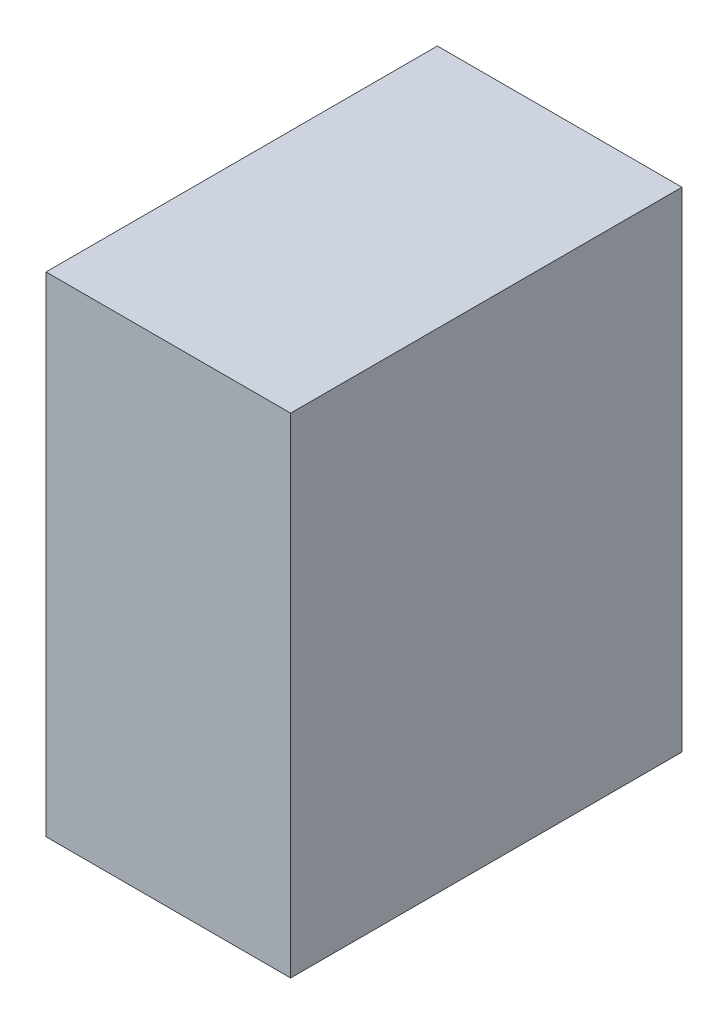
ISO-10303-21;
HEADER;
FILE_DESCRIPTION(('STEP AP214'),'2;1');
FILE_NAME('part.step','',(''),(''),'','','');
FILE_SCHEMA(('AUTOMOTIVE_DESIGN { 1 0 10303 214 1 1 1 1 }'));
ENDSEC;
DATA;
#1=APPLICATION_CONTEXT('core data for automotive mechanical design processes');
#2=APPLICATION_PROTOCOL_DEFINITION('international standard','automotive_design',2000,#1);
#3=PRODUCT_CONTEXT('',#1,'mechanical');
#4=PRODUCT('Part','Part','',(#3));
#5=PRODUCT_RELATED_PRODUCT_CATEGORY('part','',(#4));
#6=PRODUCT_DEFINITION_FORMATION('','',#4);
#7=PRODUCT_DEFINITION_CONTEXT('part definition',#1,'design');
#8=PRODUCT_DEFINITION('design','',#6,#7);
#9=PRODUCT_DEFINITION_SHAPE('','',#8);
#10=(LENGTH_UNIT() NAMED_UNIT(*) SI_UNIT(.MILLI.,.METRE.));
#11=(NAMED_UNIT(*) PLANE_ANGLE_UNIT() SI_UNIT($,.RADIAN.));
#12=(NAMED_UNIT(*) SI_UNIT($,.STERADIAN.) SOLID_ANGLE_UNIT());
#13=UNCERTAINTY_MEASURE_WITH_UNIT(LENGTH_MEASURE(1.E-05),#10,'distance_accuracy_value','');
#14=(GEOMETRIC_REPRESENTATION_CONTEXT(3) GLOBAL_UNCERTAINTY_ASSIGNED_CONTEXT((#13)) GLOBAL_UNIT_ASSIGNED_CONTEXT((#10,
#11,#12)) REPRESENTATION_CONTEXT('',''));
#15=CARTESIAN_POINT('',(0.,0.,0.));
#16=DIRECTION('',(0.,0.,1.));
#17=DIRECTION('',(1.,0.,0.));
#18=AXIS2_PLACEMENT_3D('',#15,#16,#17);
#19=CARTESIAN_POINT('',(-49.9999999999999,53.6184210526316,80.));
#20=DIRECTION('',(1.,0.,0.));
#21=DIRECTION('',(0.,0.,-1.));
#22=AXIS2_PLACEMENT_3D('',#19,#20,#21);
#23=PLANE('',#22);
#24=DIRECTION('',(0.,-1.,0.));
#25=VECTOR('',#24,1.);
#26=CARTESIAN_POINT('',(-49.9999999999999,53.6184210526316,0.));
#27=LINE('',#26,#25);
#28=CARTESIAN_POINT('',(-49.9999999999999,53.6184210526316,0.));
#29=VERTEX_POINT('',#28);
#30=CARTESIAN_POINT('',(-49.9999999999999,-46.3815789473684,0.));
#31=VERTEX_POINT('',#30);
#32=EDGE_CURVE('E107',#29,#31,#27,.T.);
#33=ORIENTED_EDGE('',*,*,#32,.T.);
#34=DIRECTION('',(0.,0.,-1.));
#35=VECTOR('',#34,1.);
#36=CARTESIAN_POINT('',(-49.9999999999999,-46.3815789473684,80.));
#37=LINE('',#36,#35);
#38=CARTESIAN_POINT('',(-49.9999999999999,-46.3815789473684,80.));
#39=VERTEX_POINT('',#38);
#40=EDGE_CURVE('E11',#39,#31,#37,.T.);
#41=ORIENTED_EDGE('',*,*,#40,.F.);
#42=DIRECTION('',(0.,-1.,0.));
#43=VECTOR('',#42,1.);
#44=CARTESIAN_POINT('',(-49.9999999999999,53.6184210526316,80.));
#45=LINE('',#44,#43);
#46=CARTESIAN_POINT('',(-49.9999999999999,53.6184210526316,80.));
#47=VERTEX_POINT('',#46);
#48=EDGE_CURVE('E91',#47,#39,#45,.T.);
#49=ORIENTED_EDGE('',*,*,#48,.F.);
#50=DIRECTION('',(0.,0.,-1.));
#51=VECTOR('',#50,1.);
#52=CARTESIAN_POINT('',(-49.9999999999999,53.6184210526316,80.));
#53=LINE('',#52,#51);
#54=EDGE_CURVE('E103',#47,#29,#53,.T.);
#55=ORIENTED_EDGE('',*,*,#54,.T.);
#56=EDGE_LOOP('',(#33,#41,#49,#55));
#57=FACE_BOUND('',#56,.T.);
#58=ADVANCED_FACE('F39',(#57),#23,.F.);
#59=CARTESIAN_POINT('',(-49.9999999999999,-46.3815789473684,80.));
#60=DIRECTION('',(0.,1.,0.));
#61=DIRECTION('',(-1.,0.,0.));
#62=AXIS2_PLACEMENT_3D('',#59,#60,#61);
#63=PLANE('',#62);
#64=DIRECTION('',(1.,0.,0.));
#65=VECTOR('',#64,1.);
#66=CARTESIAN_POINT('',(-49.9999999999999,-46.3815789473684,0.));
#67=LINE('',#66,#65);
#68=CARTESIAN_POINT('',(0.,-46.3815789473684,0.));
#69=VERTEX_POINT('',#68);
#70=EDGE_CURVE('E96',#31,#69,#67,.T.);
#71=ORIENTED_EDGE('',*,*,#70,.T.);
#72=DIRECTION('',(0.,0.,-1.));
#73=VECTOR('',#72,1.);
#74=CARTESIAN_POINT('',(0.,-46.3815789473684,80.));
#75=LINE('',#74,#73);
#76=CARTESIAN_POINT('',(0.,-46.3815789473684,80.));
#77=VERTEX_POINT('',#76);
#78=EDGE_CURVE('E48',#77,#69,#75,.T.);
#79=ORIENTED_EDGE('',*,*,#78,.F.);
#80=DIRECTION('',(1.,0.,0.));
#81=VECTOR('',#80,1.);
#82=CARTESIAN_POINT('',(-49.9999999999999,-46.3815789473684,80.));
#83=LINE('',#82,#81);
#84=EDGE_CURVE('E86',#39,#77,#83,.T.);
#85=ORIENTED_EDGE('',*,*,#84,.F.);
#86=ORIENTED_EDGE('',*,*,#40,.T.);
#87=EDGE_LOOP('',(#71,#79,#85,#86));
#88=FACE_BOUND('',#87,.T.);
#89=ADVANCED_FACE('F95',(#88),#63,.F.);
#90=CARTESIAN_POINT('',(0.,53.6184210526316,80.));
#91=DIRECTION('',(-1.,0.,0.));
#92=DIRECTION('',(0.,-1.,0.));
#93=AXIS2_PLACEMENT_3D('',#90,#91,#92);
#94=PLANE('',#93);
#95=DIRECTION('',(0.,1.,0.));
#96=VECTOR('',#95,1.);
#97=CARTESIAN_POINT('',(0.,53.6184210526316,0.));
#98=LINE('',#97,#96);
#99=CARTESIAN_POINT('',(0.,53.6184210526316,0.));
#100=VERTEX_POINT('',#99);
#101=EDGE_CURVE('E73',#69,#100,#98,.T.);
#102=ORIENTED_EDGE('',*,*,#101,.T.);
#103=DIRECTION('',(0.,0.,-1.));
#104=VECTOR('',#103,1.);
#105=CARTESIAN_POINT('',(0.,53.6184210526316,80.));
#106=LINE('',#105,#104);
#107=CARTESIAN_POINT('',(0.,53.6184210526316,80.));
#108=VERTEX_POINT('',#107);
#109=EDGE_CURVE('E98',#108,#100,#106,.T.);
#110=ORIENTED_EDGE('',*,*,#109,.F.);
#111=DIRECTION('',(0.,1.,0.));
#112=VECTOR('',#111,1.);
#113=CARTESIAN_POINT('',(0.,53.6184210526316,80.));
#114=LINE('',#113,#112);
#115=EDGE_CURVE('E89',#77,#108,#114,.T.);
#116=ORIENTED_EDGE('',*,*,#115,.F.);
#117=ORIENTED_EDGE('',*,*,#78,.T.);
#118=EDGE_LOOP('',(#102,#110,#116,#117));
#119=FACE_BOUND('',#118,.T.);
#120=ADVANCED_FACE('F99',(#119),#94,.F.);
#121=CARTESIAN_POINT('',(-49.9999999999999,53.6184210526316,80.));
#122=DIRECTION('',(0.,-1.,0.));
#123=DIRECTION('',(0.,0.,-1.));
#124=AXIS2_PLACEMENT_3D('',#121,#122,#123);
#125=PLANE('',#124);
#126=DIRECTION('',(-1.,0.,0.));
#127=VECTOR('',#126,1.);
#128=CARTESIAN_POINT('',(-49.9999999999999,53.6184210526316,0.));
#129=LINE('',#128,#127);
#130=EDGE_CURVE('E79',#100,#29,#129,.T.);
#131=ORIENTED_EDGE('',*,*,#130,.T.);
#132=ORIENTED_EDGE('',*,*,#54,.F.);
#133=DIRECTION('',(-1.,0.,0.));
#134=VECTOR('',#133,1.);
#135=CARTESIAN_POINT('',(-49.9999999999999,53.6184210526316,80.));
#136=LINE('',#135,#134);
#137=EDGE_CURVE('E56',#108,#47,#136,.T.);
#138=ORIENTED_EDGE('',*,*,#137,.F.);
#139=ORIENTED_EDGE('',*,*,#109,.T.);
#140=EDGE_LOOP('',(#131,#132,#138,#139));
#141=FACE_BOUND('',#140,.T.);
#142=ADVANCED_FACE('F120',(#141),#125,.F.);
#143=CARTESIAN_POINT('',(0.,0.,80.));
#144=DIRECTION('',(0.,0.,1.));
#145=DIRECTION('',(1.,0.,0.));
#146=AXIS2_PLACEMENT_3D('',#143,#144,#145);
#147=PLANE('',#146);
#148=ORIENTED_EDGE('',*,*,#48,.T.);
#149=ORIENTED_EDGE('',*,*,#84,.T.);
#150=ORIENTED_EDGE('',*,*,#115,.T.);
#151=ORIENTED_EDGE('',*,*,#137,.T.);
#152=EDGE_LOOP('',(#148,#149,#150,#151));
#153=FACE_BOUND('',#152,.T.);
#154=ADVANCED_FACE('F87',(#153),#147,.T.);
#155=CARTESIAN_POINT('',(0.,0.,0.));
#156=DIRECTION('',(0.,0.,1.));
#157=DIRECTION('',(1.,0.,0.));
#158=AXIS2_PLACEMENT_3D('',#155,#156,#157);
#159=PLANE('',#158);
#160=ORIENTED_EDGE('',*,*,#32,.F.);
#161=ORIENTED_EDGE('',*,*,#130,.F.);
#162=ORIENTED_EDGE('',*,*,#101,.F.);
#163=ORIENTED_EDGE('',*,*,#70,.F.);
#164=EDGE_LOOP('',(#160,#161,#162,#163));
#165=FACE_BOUND('',#164,.T.);
#166=ADVANCED_FACE('F123',(#165),#159,.F.);
#167=CLOSED_SHELL('',(#58,#89,#120,#142,#154,#166));
#168=MANIFOLD_SOLID_BREP('B2',#167);
#169=ADVANCED_BREP_SHAPE_REPRESENTATION('',(#18,#168),#14);
#170=SHAPE_DEFINITION_REPRESENTATION(#9,#169);
ENDSEC;
END-ISO-10303-21;
